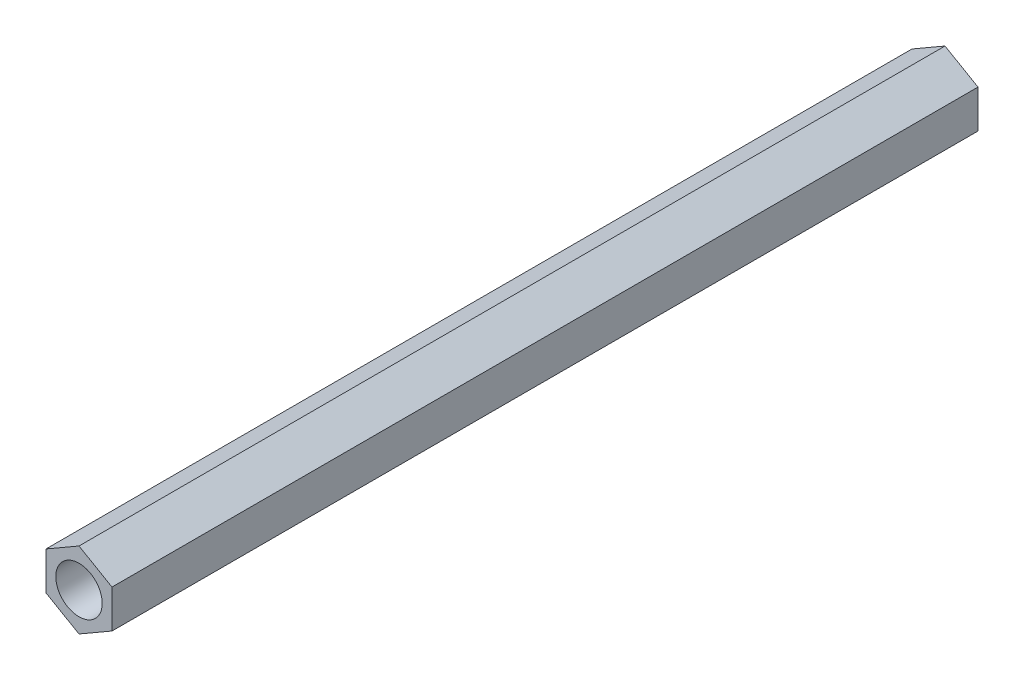
ISO-10303-21;
HEADER;
FILE_DESCRIPTION(('STEP AP214'),'2;1');
FILE_NAME('part.step','',(''),(''),'','','');
FILE_SCHEMA(('AUTOMOTIVE_DESIGN { 1 0 10303 214 1 1 1 1 }'));
ENDSEC;
DATA;
#1=APPLICATION_CONTEXT('core data for automotive mechanical design processes');
#2=APPLICATION_PROTOCOL_DEFINITION('international standard','automotive_design',2000,#1);
#3=PRODUCT_CONTEXT('',#1,'mechanical');
#4=PRODUCT('Part','Part','',(#3));
#5=PRODUCT_RELATED_PRODUCT_CATEGORY('part','',(#4));
#6=PRODUCT_DEFINITION_FORMATION('','',#4);
#7=PRODUCT_DEFINITION_CONTEXT('part definition',#1,'design');
#8=PRODUCT_DEFINITION('design','',#6,#7);
#9=PRODUCT_DEFINITION_SHAPE('','',#8);
#10=(LENGTH_UNIT() NAMED_UNIT(*) SI_UNIT(.MILLI.,.METRE.));
#11=(NAMED_UNIT(*) PLANE_ANGLE_UNIT() SI_UNIT($,.RADIAN.));
#12=(NAMED_UNIT(*) SI_UNIT($,.STERADIAN.) SOLID_ANGLE_UNIT());
#13=UNCERTAINTY_MEASURE_WITH_UNIT(LENGTH_MEASURE(1.E-05),#10,'distance_accuracy_value','');
#14=(GEOMETRIC_REPRESENTATION_CONTEXT(3) GLOBAL_UNCERTAINTY_ASSIGNED_CONTEXT((#13)) GLOBAL_UNIT_ASSIGNED_CONTEXT((#10,
#11,#12)) REPRESENTATION_CONTEXT('',''));
#15=CARTESIAN_POINT('',(0.,0.,0.));
#16=DIRECTION('',(0.,0.,1.));
#17=DIRECTION('',(1.,0.,0.));
#18=AXIS2_PLACEMENT_3D('',#15,#16,#17);
#19=CARTESIAN_POINT('',(0.,0.,56.));
#20=DIRECTION('',(0.,0.,1.));
#21=DIRECTION('',(1.,0.,0.));
#22=AXIS2_PLACEMENT_3D('',#19,#20,#21);
#23=PLANE('',#22);
#24=DIRECTION('',(-0.866025403784442,0.499999999999995,0.));
#25=VECTOR('',#24,1.);
#26=CARTESIAN_POINT('',(2.13382530169226,1.23196461233569,56.));
#27=LINE('',#26,#25);
#28=CARTESIAN_POINT('',(2.13382530169226,1.23196461233569,56.));
#29=VERTEX_POINT('',#28);
#30=CARTESIAN_POINT('',(0.,2.46392922467133,56.));
#31=VERTEX_POINT('',#30);
#32=EDGE_CURVE('E133',#29,#31,#27,.T.);
#33=ORIENTED_EDGE('',*,*,#32,.T.);
#34=DIRECTION('',(-0.866025403784438,-0.500000000000001,0.));
#35=VECTOR('',#34,1.);
#36=CARTESIAN_POINT('',(0.,2.46392922467133,56.));
#37=LINE('',#36,#35);
#38=CARTESIAN_POINT('',(-2.13382530169227,1.23196461233566,56.));
#39=VERTEX_POINT('',#38);
#40=EDGE_CURVE('E91',#31,#39,#37,.T.);
#41=ORIENTED_EDGE('',*,*,#40,.T.);
#42=DIRECTION('',(0.,-1.,0.));
#43=VECTOR('',#42,1.);
#44=CARTESIAN_POINT('',(-2.13382530169227,1.23196461233566,56.));
#45=LINE('',#44,#43);
#46=CARTESIAN_POINT('',(-2.13382530169226,-1.23196461233568,56.));
#47=VERTEX_POINT('',#46);
#48=EDGE_CURVE('E104',#39,#47,#45,.T.);
#49=ORIENTED_EDGE('',*,*,#48,.T.);
#50=DIRECTION('',(0.866025403784442,-0.499999999999995,0.));
#51=VECTOR('',#50,1.);
#52=CARTESIAN_POINT('',(-2.13382530169226,-1.23196461233568,56.));
#53=LINE('',#52,#51);
#54=CARTESIAN_POINT('',(0.,-2.46392922467133,56.));
#55=VERTEX_POINT('',#54);
#56=EDGE_CURVE('E98',#47,#55,#53,.T.);
#57=ORIENTED_EDGE('',*,*,#56,.T.);
#58=DIRECTION('',(0.866025403784434,0.500000000000007,0.));
#59=VECTOR('',#58,1.);
#60=CARTESIAN_POINT('',(0.,-2.46392922467133,56.));
#61=LINE('',#60,#59);
#62=CARTESIAN_POINT('',(2.13382530169228,-1.23196461233565,56.));
#63=VERTEX_POINT('',#62);
#64=EDGE_CURVE('E102',#55,#63,#61,.T.);
#65=ORIENTED_EDGE('',*,*,#64,.T.);
#66=DIRECTION('',(0.,1.,0.));
#67=VECTOR('',#66,1.);
#68=CARTESIAN_POINT('',(2.13382530169228,-1.23196461233565,56.));
#69=LINE('',#68,#67);
#70=EDGE_CURVE('E54',#63,#29,#69,.T.);
#71=ORIENTED_EDGE('',*,*,#70,.T.);
#72=EDGE_LOOP('',(#33,#41,#49,#57,#65,#71));
#73=FACE_BOUND('',#72,.T.);
#74=CARTESIAN_POINT('',(0.,0.,56.));
#75=DIRECTION('',(0.,0.,1.));
#76=DIRECTION('',(1.,0.,0.));
#77=AXIS2_PLACEMENT_3D('',#74,#75,#76);
#78=CIRCLE('',#77,1.5);
#79=CARTESIAN_POINT('',(1.5,0.,56.));
#80=VERTEX_POINT('',#79);
#81=EDGE_CURVE('E126',#80,#80,#78,.T.);
#82=ORIENTED_EDGE('',*,*,#81,.F.);
#83=EDGE_LOOP('',(#82));
#84=FACE_BOUND('',#83,.T.);
#85=ADVANCED_FACE('F37',(#73,#84),#23,.T.);
#86=CARTESIAN_POINT('',(0.,0.,0.));
#87=DIRECTION('',(0.,0.,1.));
#88=DIRECTION('',(1.,0.,0.));
#89=AXIS2_PLACEMENT_3D('',#86,#87,#88);
#90=PLANE('',#89);
#91=DIRECTION('',(-0.866025403784442,0.499999999999995,0.));
#92=VECTOR('',#91,1.);
#93=CARTESIAN_POINT('',(2.13382530169226,1.23196461233569,0.));
#94=LINE('',#93,#92);
#95=CARTESIAN_POINT('',(2.13382530169226,1.23196461233569,0.));
#96=VERTEX_POINT('',#95);
#97=CARTESIAN_POINT('',(0.,2.46392922467133,0.));
#98=VERTEX_POINT('',#97);
#99=EDGE_CURVE('E122',#96,#98,#94,.T.);
#100=ORIENTED_EDGE('',*,*,#99,.F.);
#101=DIRECTION('',(0.,1.,0.));
#102=VECTOR('',#101,1.);
#103=CARTESIAN_POINT('',(2.13382530169228,-1.23196461233565,0.));
#104=LINE('',#103,#102);
#105=CARTESIAN_POINT('',(2.13382530169228,-1.23196461233565,0.));
#106=VERTEX_POINT('',#105);
#107=EDGE_CURVE('E83',#106,#96,#104,.T.);
#108=ORIENTED_EDGE('',*,*,#107,.F.);
#109=DIRECTION('',(0.866025403784434,0.500000000000007,0.));
#110=VECTOR('',#109,1.);
#111=CARTESIAN_POINT('',(0.,-2.46392922467133,0.));
#112=LINE('',#111,#110);
#113=CARTESIAN_POINT('',(0.,-2.46392922467133,0.));
#114=VERTEX_POINT('',#113);
#115=EDGE_CURVE('E77',#114,#106,#112,.T.);
#116=ORIENTED_EDGE('',*,*,#115,.F.);
#117=DIRECTION('',(0.866025403784442,-0.499999999999995,0.));
#118=VECTOR('',#117,1.);
#119=CARTESIAN_POINT('',(-2.13382530169226,-1.23196461233568,0.));
#120=LINE('',#119,#118);
#121=CARTESIAN_POINT('',(-2.13382530169226,-1.23196461233568,0.));
#122=VERTEX_POINT('',#121);
#123=EDGE_CURVE('E112',#122,#114,#120,.T.);
#124=ORIENTED_EDGE('',*,*,#123,.F.);
#125=DIRECTION('',(0.,-1.,0.));
#126=VECTOR('',#125,1.);
#127=CARTESIAN_POINT('',(-2.13382530169227,1.23196461233566,0.));
#128=LINE('',#127,#126);
#129=CARTESIAN_POINT('',(-2.13382530169227,1.23196461233566,0.));
#130=VERTEX_POINT('',#129);
#131=EDGE_CURVE('E128',#130,#122,#128,.T.);
#132=ORIENTED_EDGE('',*,*,#131,.F.);
#133=DIRECTION('',(-0.866025403784438,-0.500000000000001,0.));
#134=VECTOR('',#133,1.);
#135=CARTESIAN_POINT('',(0.,2.46392922467133,0.));
#136=LINE('',#135,#134);
#137=EDGE_CURVE('E125',#98,#130,#136,.T.);
#138=ORIENTED_EDGE('',*,*,#137,.F.);
#139=EDGE_LOOP('',(#100,#108,#116,#124,#132,#138));
#140=FACE_BOUND('',#139,.T.);
#141=CARTESIAN_POINT('',(0.,0.,0.));
#142=DIRECTION('',(0.,0.,1.));
#143=DIRECTION('',(1.,0.,0.));
#144=AXIS2_PLACEMENT_3D('',#141,#142,#143);
#145=CIRCLE('',#144,1.5);
#146=CARTESIAN_POINT('',(1.5,0.,0.));
#147=VERTEX_POINT('',#146);
#148=EDGE_CURVE('E226',#147,#147,#145,.T.);
#149=ORIENTED_EDGE('',*,*,#148,.T.);
#150=EDGE_LOOP('',(#149));
#151=FACE_BOUND('',#150,.T.);
#152=ADVANCED_FACE('F142',(#140,#151),#90,.F.);
#153=CARTESIAN_POINT('',(2.13382530169226,1.23196461233569,56.));
#154=DIRECTION('',(-0.499999999999995,-0.866025403784442,0.));
#155=DIRECTION('',(0.866025403784442,-0.499999999999995,0.));
#156=AXIS2_PLACEMENT_3D('',#153,#154,#155);
#157=PLANE('',#156);
#158=ORIENTED_EDGE('',*,*,#99,.T.);
#159=DIRECTION('',(0.,0.,-1.));
#160=VECTOR('',#159,1.);
#161=CARTESIAN_POINT('',(0.,2.46392922467133,56.));
#162=LINE('',#161,#160);
#163=EDGE_CURVE('E11',#31,#98,#162,.T.);
#164=ORIENTED_EDGE('',*,*,#163,.F.);
#165=ORIENTED_EDGE('',*,*,#32,.F.);
#166=DIRECTION('',(0.,0.,-1.));
#167=VECTOR('',#166,1.);
#168=CARTESIAN_POINT('',(2.13382530169226,1.23196461233569,56.));
#169=LINE('',#168,#167);
#170=EDGE_CURVE('E118',#29,#96,#169,.T.);
#171=ORIENTED_EDGE('',*,*,#170,.T.);
#172=EDGE_LOOP('',(#158,#164,#165,#171));
#173=FACE_BOUND('',#172,.T.);
#174=ADVANCED_FACE('F39',(#173),#157,.F.);
#175=CARTESIAN_POINT('',(0.,2.46392922467133,56.));
#176=DIRECTION('',(0.500000000000001,-0.866025403784438,0.));
#177=DIRECTION('',(0.866025403784438,0.500000000000001,0.));
#178=AXIS2_PLACEMENT_3D('',#175,#176,#177);
#179=PLANE('',#178);
#180=ORIENTED_EDGE('',*,*,#137,.T.);
#181=DIRECTION('',(0.,0.,-1.));
#182=VECTOR('',#181,1.);
#183=CARTESIAN_POINT('',(-2.13382530169227,1.23196461233566,56.));
#184=LINE('',#183,#182);
#185=EDGE_CURVE('E46',#39,#130,#184,.T.);
#186=ORIENTED_EDGE('',*,*,#185,.F.);
#187=ORIENTED_EDGE('',*,*,#40,.F.);
#188=ORIENTED_EDGE('',*,*,#163,.T.);
#189=EDGE_LOOP('',(#180,#186,#187,#188));
#190=FACE_BOUND('',#189,.T.);
#191=ADVANCED_FACE('F167',(#190),#179,.F.);
#192=CARTESIAN_POINT('',(-2.13382530169227,1.23196461233566,56.));
#193=DIRECTION('',(1.,0.,0.));
#194=DIRECTION('',(0.,1.,0.));
#195=AXIS2_PLACEMENT_3D('',#192,#193,#194);
#196=PLANE('',#195);
#197=ORIENTED_EDGE('',*,*,#131,.T.);
#198=DIRECTION('',(0.,0.,-1.));
#199=VECTOR('',#198,1.);
#200=CARTESIAN_POINT('',(-2.13382530169226,-1.23196461233568,56.));
#201=LINE('',#200,#199);
#202=EDGE_CURVE('E113',#47,#122,#201,.T.);
#203=ORIENTED_EDGE('',*,*,#202,.F.);
#204=ORIENTED_EDGE('',*,*,#48,.F.);
#205=ORIENTED_EDGE('',*,*,#185,.T.);
#206=EDGE_LOOP('',(#197,#203,#204,#205));
#207=FACE_BOUND('',#206,.T.);
#208=ADVANCED_FACE('F139',(#207),#196,.F.);
#209=CARTESIAN_POINT('',(-2.13382530169226,-1.23196461233568,56.));
#210=DIRECTION('',(0.499999999999995,0.866025403784442,0.));
#211=DIRECTION('',(-0.866025403784442,0.499999999999995,0.));
#212=AXIS2_PLACEMENT_3D('',#209,#210,#211);
#213=PLANE('',#212);
#214=ORIENTED_EDGE('',*,*,#123,.T.);
#215=DIRECTION('',(0.,0.,-1.));
#216=VECTOR('',#215,1.);
#217=CARTESIAN_POINT('',(0.,-2.46392922467133,56.));
#218=LINE('',#217,#216);
#219=EDGE_CURVE('E109',#55,#114,#218,.T.);
#220=ORIENTED_EDGE('',*,*,#219,.F.);
#221=ORIENTED_EDGE('',*,*,#56,.F.);
#222=ORIENTED_EDGE('',*,*,#202,.T.);
#223=EDGE_LOOP('',(#214,#220,#221,#222));
#224=FACE_BOUND('',#223,.T.);
#225=ADVANCED_FACE('F110',(#224),#213,.F.);
#226=CARTESIAN_POINT('',(0.,-2.46392922467133,56.));
#227=DIRECTION('',(-0.500000000000007,0.866025403784434,0.));
#228=DIRECTION('',(-0.866025403784435,-0.500000000000007,0.));
#229=AXIS2_PLACEMENT_3D('',#226,#227,#228);
#230=PLANE('',#229);
#231=ORIENTED_EDGE('',*,*,#115,.T.);
#232=DIRECTION('',(0.,0.,-1.));
#233=VECTOR('',#232,1.);
#234=CARTESIAN_POINT('',(2.13382530169228,-1.23196461233565,56.));
#235=LINE('',#234,#233);
#236=EDGE_CURVE('E114',#63,#106,#235,.T.);
#237=ORIENTED_EDGE('',*,*,#236,.F.);
#238=ORIENTED_EDGE('',*,*,#64,.F.);
#239=ORIENTED_EDGE('',*,*,#219,.T.);
#240=EDGE_LOOP('',(#231,#237,#238,#239));
#241=FACE_BOUND('',#240,.T.);
#242=ADVANCED_FACE('F116',(#241),#230,.F.);
#243=CARTESIAN_POINT('',(2.13382530169228,-1.23196461233565,56.));
#244=DIRECTION('',(-1.,0.,0.));
#245=DIRECTION('',(0.,-1.,0.));
#246=AXIS2_PLACEMENT_3D('',#243,#244,#245);
#247=PLANE('',#246);
#248=ORIENTED_EDGE('',*,*,#107,.T.);
#249=ORIENTED_EDGE('',*,*,#170,.F.);
#250=ORIENTED_EDGE('',*,*,#70,.F.);
#251=ORIENTED_EDGE('',*,*,#236,.T.);
#252=EDGE_LOOP('',(#248,#249,#250,#251));
#253=FACE_BOUND('',#252,.T.);
#254=ADVANCED_FACE('F147',(#253),#247,.F.);
#255=CARTESIAN_POINT('',(0.,0.,56.));
#256=DIRECTION('',(0.,0.,-1.));
#257=DIRECTION('',(-1.,0.,0.));
#258=AXIS2_PLACEMENT_3D('',#255,#256,#257);
#259=CYLINDRICAL_SURFACE('',#258,1.5);
#260=ORIENTED_EDGE('',*,*,#81,.T.);
#261=EDGE_LOOP('',(#260));
#262=FACE_BOUND('',#261,.T.);
#263=ORIENTED_EDGE('',*,*,#148,.F.);
#264=EDGE_LOOP('',(#263));
#265=FACE_BOUND('',#264,.T.);
#266=ADVANCED_FACE('F149',(#262,#265),#259,.F.);
#267=CLOSED_SHELL('',(#85,#152,#174,#191,#208,#225,#242,#254,#266));
#268=MANIFOLD_SOLID_BREP('B2',#267);
#269=ADVANCED_BREP_SHAPE_REPRESENTATION('',(#18,#268),#14);
#270=SHAPE_DEFINITION_REPRESENTATION(#9,#269);
ENDSEC;
END-ISO-10303-21;
